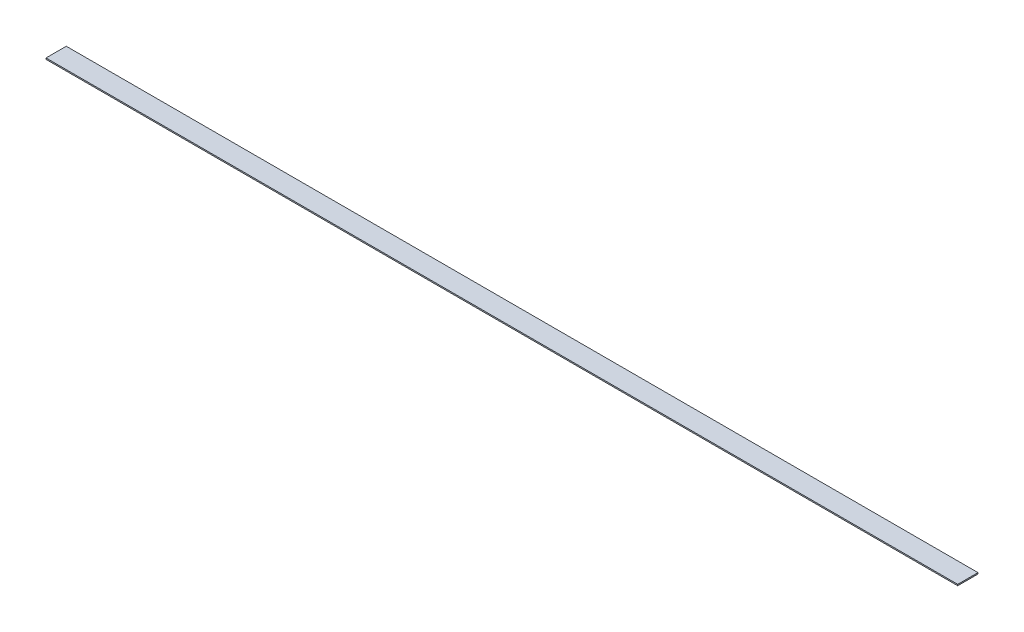
ISO-10303-21;
HEADER;
FILE_DESCRIPTION(('STEP AP214'),'2;1');
FILE_NAME('part.step','',(''),(''),'','','');
FILE_SCHEMA(('AUTOMOTIVE_DESIGN { 1 0 10303 214 1 1 1 1 }'));
ENDSEC;
DATA;
#1=APPLICATION_CONTEXT('core data for automotive mechanical design processes');
#2=APPLICATION_PROTOCOL_DEFINITION('international standard','automotive_design',2000,#1);
#3=PRODUCT_CONTEXT('',#1,'mechanical');
#4=PRODUCT('Part','Part','',(#3));
#5=PRODUCT_RELATED_PRODUCT_CATEGORY('part','',(#4));
#6=PRODUCT_DEFINITION_FORMATION('','',#4);
#7=PRODUCT_DEFINITION_CONTEXT('part definition',#1,'design');
#8=PRODUCT_DEFINITION('design','',#6,#7);
#9=PRODUCT_DEFINITION_SHAPE('','',#8);
#10=(LENGTH_UNIT() NAMED_UNIT(*) SI_UNIT(.MILLI.,.METRE.));
#11=(NAMED_UNIT(*) PLANE_ANGLE_UNIT() SI_UNIT($,.RADIAN.));
#12=(NAMED_UNIT(*) SI_UNIT($,.STERADIAN.) SOLID_ANGLE_UNIT());
#13=UNCERTAINTY_MEASURE_WITH_UNIT(LENGTH_MEASURE(1.E-05),#10,'distance_accuracy_value','');
#14=(GEOMETRIC_REPRESENTATION_CONTEXT(3) GLOBAL_UNCERTAINTY_ASSIGNED_CONTEXT((#13)) GLOBAL_UNIT_ASSIGNED_CONTEXT((#10,
#11,#12)) REPRESENTATION_CONTEXT('',''));
#15=CARTESIAN_POINT('',(0.,0.,0.));
#16=DIRECTION('',(0.,0.,1.));
#17=DIRECTION('',(1.,0.,0.));
#18=AXIS2_PLACEMENT_3D('',#15,#16,#17);
#19=CARTESIAN_POINT('',(-571.5,1.5875,12.7000000000001));
#20=DIRECTION('',(1.,0.,0.));
#21=DIRECTION('',(0.,0.,-1.));
#22=AXIS2_PLACEMENT_3D('',#19,#20,#21);
#23=PLANE('',#22);
#24=DIRECTION('',(0.,0.,1.));
#25=VECTOR('',#24,1.);
#26=CARTESIAN_POINT('',(-571.5,0.,12.7000000000001));
#27=LINE('',#26,#25);
#28=CARTESIAN_POINT('',(-571.5,0.,-12.6999999999999));
#29=VERTEX_POINT('',#28);
#30=CARTESIAN_POINT('',(-571.5,0.,12.7000000000001));
#31=VERTEX_POINT('',#30);
#32=EDGE_CURVE('E97',#29,#31,#27,.T.);
#33=ORIENTED_EDGE('',*,*,#32,.T.);
#34=DIRECTION('',(0.,-1.,0.));
#35=VECTOR('',#34,1.);
#36=CARTESIAN_POINT('',(-571.5,1.5875,12.7000000000001));
#37=LINE('',#36,#35);
#38=CARTESIAN_POINT('',(-571.5,1.5875,12.7000000000001));
#39=VERTEX_POINT('',#38);
#40=EDGE_CURVE('E11',#39,#31,#37,.T.);
#41=ORIENTED_EDGE('',*,*,#40,.F.);
#42=DIRECTION('',(0.,0.,1.));
#43=VECTOR('',#42,1.);
#44=CARTESIAN_POINT('',(-571.5,1.5875,12.7000000000001));
#45=LINE('',#44,#43);
#46=CARTESIAN_POINT('',(-571.5,1.5875,-12.6999999999999));
#47=VERTEX_POINT('',#46);
#48=EDGE_CURVE('E85',#47,#39,#45,.T.);
#49=ORIENTED_EDGE('',*,*,#48,.F.);
#50=DIRECTION('',(0.,-1.,0.));
#51=VECTOR('',#50,1.);
#52=CARTESIAN_POINT('',(-571.5,1.5875,-12.6999999999999));
#53=LINE('',#52,#51);
#54=EDGE_CURVE('E93',#47,#29,#53,.T.);
#55=ORIENTED_EDGE('',*,*,#54,.T.);
#56=EDGE_LOOP('',(#33,#41,#49,#55));
#57=FACE_BOUND('',#56,.T.);
#58=ADVANCED_FACE('F34',(#57),#23,.F.);
#59=CARTESIAN_POINT('',(571.5,1.5875,12.6999999999999));
#60=DIRECTION('',(0.,0.,-1.));
#61=DIRECTION('',(-1.,0.,0.));
#62=AXIS2_PLACEMENT_3D('',#59,#60,#61);
#63=PLANE('',#62);
#64=DIRECTION('',(1.,0.,0.));
#65=VECTOR('',#64,1.);
#66=CARTESIAN_POINT('',(571.5,0.,12.6999999999999));
#67=LINE('',#66,#65);
#68=CARTESIAN_POINT('',(571.5,0.,12.6999999999999));
#69=VERTEX_POINT('',#68);
#70=EDGE_CURVE('E89',#31,#69,#67,.T.);
#71=ORIENTED_EDGE('',*,*,#70,.T.);
#72=DIRECTION('',(0.,-1.,0.));
#73=VECTOR('',#72,1.);
#74=CARTESIAN_POINT('',(571.5,1.5875,12.6999999999999));
#75=LINE('',#74,#73);
#76=CARTESIAN_POINT('',(571.5,1.5875,12.6999999999999));
#77=VERTEX_POINT('',#76);
#78=EDGE_CURVE('E42',#77,#69,#75,.T.);
#79=ORIENTED_EDGE('',*,*,#78,.F.);
#80=DIRECTION('',(1.,0.,0.));
#81=VECTOR('',#80,1.);
#82=CARTESIAN_POINT('',(571.5,1.5875,12.6999999999999));
#83=LINE('',#82,#81);
#84=EDGE_CURVE('E80',#39,#77,#83,.T.);
#85=ORIENTED_EDGE('',*,*,#84,.F.);
#86=ORIENTED_EDGE('',*,*,#40,.T.);
#87=EDGE_LOOP('',(#71,#79,#85,#86));
#88=FACE_BOUND('',#87,.T.);
#89=ADVANCED_FACE('F88',(#88),#63,.F.);
#90=CARTESIAN_POINT('',(571.5,1.5875,12.6999999999999));
#91=DIRECTION('',(-1.,0.,0.));
#92=DIRECTION('',(0.,0.,1.));
#93=AXIS2_PLACEMENT_3D('',#90,#91,#92);
#94=PLANE('',#93);
#95=DIRECTION('',(0.,0.,-1.));
#96=VECTOR('',#95,1.);
#97=CARTESIAN_POINT('',(571.5,0.,12.6999999999999));
#98=LINE('',#97,#96);
#99=CARTESIAN_POINT('',(571.5,0.,-12.7000000000001));
#100=VERTEX_POINT('',#99);
#101=EDGE_CURVE('E67',#69,#100,#98,.T.);
#102=ORIENTED_EDGE('',*,*,#101,.T.);
#103=DIRECTION('',(0.,-1.,0.));
#104=VECTOR('',#103,1.);
#105=CARTESIAN_POINT('',(571.5,1.5875,-12.7000000000001));
#106=LINE('',#105,#104);
#107=CARTESIAN_POINT('',(571.5,1.5875,-12.7000000000001));
#108=VERTEX_POINT('',#107);
#109=EDGE_CURVE('E90',#108,#100,#106,.T.);
#110=ORIENTED_EDGE('',*,*,#109,.F.);
#111=DIRECTION('',(0.,0.,-1.));
#112=VECTOR('',#111,1.);
#113=CARTESIAN_POINT('',(571.5,1.5875,12.6999999999999));
#114=LINE('',#113,#112);
#115=EDGE_CURVE('E83',#77,#108,#114,.T.);
#116=ORIENTED_EDGE('',*,*,#115,.F.);
#117=ORIENTED_EDGE('',*,*,#78,.T.);
#118=EDGE_LOOP('',(#102,#110,#116,#117));
#119=FACE_BOUND('',#118,.T.);
#120=ADVANCED_FACE('F91',(#119),#94,.F.);
#121=CARTESIAN_POINT('',(571.5,1.5875,-12.7000000000001));
#122=DIRECTION('',(0.,0.,1.));
#123=DIRECTION('',(1.,0.,0.));
#124=AXIS2_PLACEMENT_3D('',#121,#122,#123);
#125=PLANE('',#124);
#126=DIRECTION('',(-1.,0.,0.));
#127=VECTOR('',#126,1.);
#128=CARTESIAN_POINT('',(571.5,0.,-12.7000000000001));
#129=LINE('',#128,#127);
#130=EDGE_CURVE('E73',#100,#29,#129,.T.);
#131=ORIENTED_EDGE('',*,*,#130,.T.);
#132=ORIENTED_EDGE('',*,*,#54,.F.);
#133=DIRECTION('',(-1.,0.,0.));
#134=VECTOR('',#133,1.);
#135=CARTESIAN_POINT('',(571.5,1.5875,-12.7000000000001));
#136=LINE('',#135,#134);
#137=EDGE_CURVE('E50',#108,#47,#136,.T.);
#138=ORIENTED_EDGE('',*,*,#137,.F.);
#139=ORIENTED_EDGE('',*,*,#109,.T.);
#140=EDGE_LOOP('',(#131,#132,#138,#139));
#141=FACE_BOUND('',#140,.T.);
#142=ADVANCED_FACE('F104',(#141),#125,.F.);
#143=CARTESIAN_POINT('',(0.,1.5875,0.));
#144=DIRECTION('',(0.,1.,0.));
#145=DIRECTION('',(0.,0.,1.));
#146=AXIS2_PLACEMENT_3D('',#143,#144,#145);
#147=PLANE('',#146);
#148=ORIENTED_EDGE('',*,*,#48,.T.);
#149=ORIENTED_EDGE('',*,*,#84,.T.);
#150=ORIENTED_EDGE('',*,*,#115,.T.);
#151=ORIENTED_EDGE('',*,*,#137,.T.);
#152=EDGE_LOOP('',(#148,#149,#150,#151));
#153=FACE_BOUND('',#152,.T.);
#154=ADVANCED_FACE('F81',(#153),#147,.T.);
#155=CARTESIAN_POINT('',(0.,0.,0.));
#156=DIRECTION('',(0.,1.,0.));
#157=DIRECTION('',(0.,0.,1.));
#158=AXIS2_PLACEMENT_3D('',#155,#156,#157);
#159=PLANE('',#158);
#160=ORIENTED_EDGE('',*,*,#32,.F.);
#161=ORIENTED_EDGE('',*,*,#130,.F.);
#162=ORIENTED_EDGE('',*,*,#101,.F.);
#163=ORIENTED_EDGE('',*,*,#70,.F.);
#164=EDGE_LOOP('',(#160,#161,#162,#163));
#165=FACE_BOUND('',#164,.T.);
#166=ADVANCED_FACE('F107',(#165),#159,.F.);
#167=CLOSED_SHELL('',(#58,#89,#120,#142,#154,#166));
#168=MANIFOLD_SOLID_BREP('B2',#167);
#169=ADVANCED_BREP_SHAPE_REPRESENTATION('',(#18,#168),#14);
#170=SHAPE_DEFINITION_REPRESENTATION(#9,#169);
ENDSEC;
END-ISO-10303-21;
